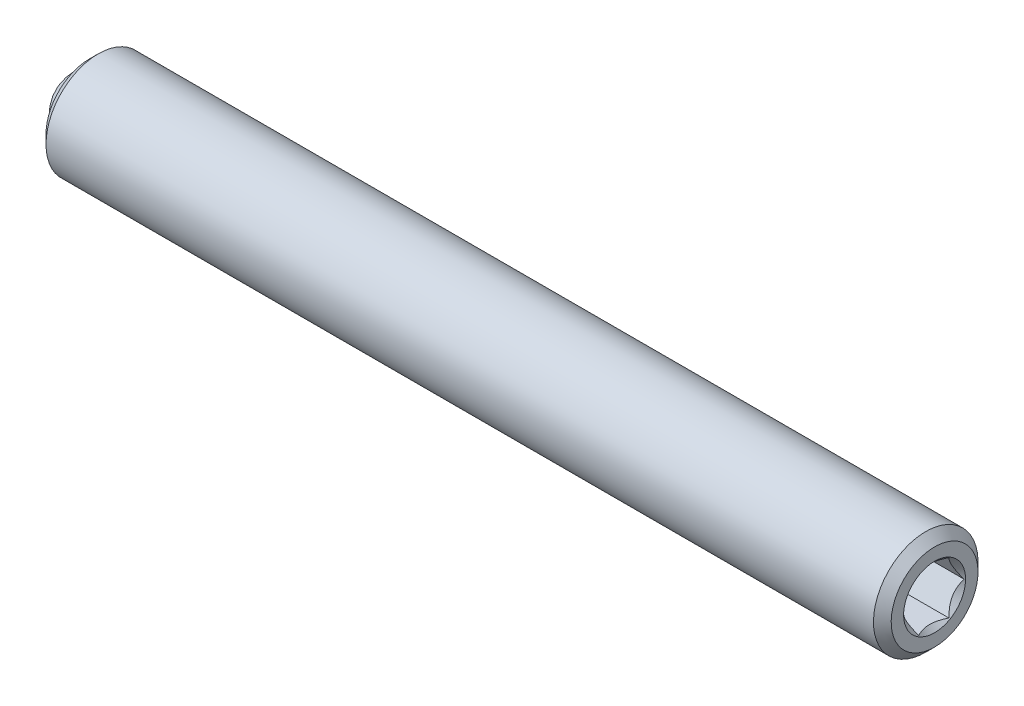
ISO-10303-21;
HEADER;
FILE_DESCRIPTION(('STEP AP214'),'2;1');
FILE_NAME('part.step','',(''),(''),'','','');
FILE_SCHEMA(('AUTOMOTIVE_DESIGN { 1 0 10303 214 1 1 1 1 }'));
ENDSEC;
DATA;
#1=APPLICATION_CONTEXT('core data for automotive mechanical design processes');
#2=APPLICATION_PROTOCOL_DEFINITION('international standard','automotive_design',2000,#1);
#3=PRODUCT_CONTEXT('',#1,'mechanical');
#4=PRODUCT('Part','Part','',(#3));
#5=PRODUCT_RELATED_PRODUCT_CATEGORY('part','',(#4));
#6=PRODUCT_DEFINITION_FORMATION('','',#4);
#7=PRODUCT_DEFINITION_CONTEXT('part definition',#1,'design');
#8=PRODUCT_DEFINITION('design','',#6,#7);
#9=PRODUCT_DEFINITION_SHAPE('','',#8);
#10=(LENGTH_UNIT() NAMED_UNIT(*) SI_UNIT(.MILLI.,.METRE.));
#11=(NAMED_UNIT(*) PLANE_ANGLE_UNIT() SI_UNIT($,.RADIAN.));
#12=(NAMED_UNIT(*) SI_UNIT($,.STERADIAN.) SOLID_ANGLE_UNIT());
#13=UNCERTAINTY_MEASURE_WITH_UNIT(LENGTH_MEASURE(1.E-05),#10,'distance_accuracy_value','');
#14=(GEOMETRIC_REPRESENTATION_CONTEXT(3) GLOBAL_UNCERTAINTY_ASSIGNED_CONTEXT((#13)) GLOBAL_UNIT_ASSIGNED_CONTEXT((#10,
#11,#12)) REPRESENTATION_CONTEXT('',''));
#15=CARTESIAN_POINT('',(0.,0.,0.));
#16=DIRECTION('',(0.,0.,1.));
#17=DIRECTION('',(1.,0.,0.));
#18=AXIS2_PLACEMENT_3D('',#15,#16,#17);
#19=CARTESIAN_POINT('',(-12.0876766483273,0.140112200938351,-0.203857779682182));
#20=DIRECTION('',(-1.,0.,0.));
#21=DIRECTION('',(0.,-1.,0.));
#22=AXIS2_PLACEMENT_3D('',#19,#20,#21);
#23=CONICAL_SURFACE('',#22,1.0033,0.785398163397449);
#24=CARTESIAN_POINT('',(-11.0843766483273,0.140112200938349,-0.203857779682182));
#25=VERTEX_POINT('',#24);
#26=VERTEX_LOOP('',#25);
#27=FACE_BOUND('',#26,.T.);
#28=CARTESIAN_POINT('',(-12.0876766483273,0.140112200938351,-0.203857779682182));
#29=DIRECTION('',(-1.,0.,0.));
#30=DIRECTION('',(0.,-1.,0.));
#31=AXIS2_PLACEMENT_3D('',#28,#29,#30);
#32=CIRCLE('',#31,1.0033);
#33=CARTESIAN_POINT('',(-12.0876766483273,-0.863187799061644,-0.203857779682182));
#34=VERTEX_POINT('',#33);
#35=EDGE_CURVE('P0_E102',#34,#34,#32,.T.);
#36=ORIENTED_EDGE('',*,*,#35,.T.);
#37=EDGE_LOOP('',(#36));
#38=FACE_BOUND('',#37,.T.);
#39=ADVANCED_FACE('P0_F17',(#27,#38),#23,.F.);
#40=CARTESIAN_POINT('',(11.4962410382164,0.140112200938291,-0.203857779682182));
#41=DIRECTION('',(-1.,0.,0.));
#42=DIRECTION('',(0.,-1.,0.));
#43=AXIS2_PLACEMENT_3D('',#40,#41,#42);
#44=PLANE('',#43);
#45=CARTESIAN_POINT('',(11.4962410382164,0.140112200938306,-0.203857779682182));
#46=DIRECTION('',(1.,0.,0.));
#47=DIRECTION('',(0.,1.,0.));
#48=AXIS2_PLACEMENT_3D('',#45,#46,#47);
#49=CIRCLE('',#48,0.889);
#50=CARTESIAN_POINT('',(11.4962410382164,1.02911220093831,-0.203857779682182));
#51=VERTEX_POINT('',#50);
#52=EDGE_CURVE('P0_E233',#51,#51,#49,.T.);
#53=ORIENTED_EDGE('',*,*,#52,.F.);
#54=EDGE_LOOP('',(#53));
#55=FACE_BOUND('',#54,.T.);
#56=CARTESIAN_POINT('',(11.4962410382164,0.140112200938291,-0.203857779682182));
#57=DIRECTION('',(-1.,0.,0.));
#58=DIRECTION('',(0.,-1.,0.));
#59=AXIS2_PLACEMENT_3D('',#56,#57,#58);
#60=CIRCLE('',#59,1.24599999999999);
#61=CARTESIAN_POINT('',(11.4962410382164,-1.1058877990617,-0.203857779682182));
#62=VERTEX_POINT('',#61);
#63=EDGE_CURVE('P0_E114',#62,#62,#60,.F.);
#64=ORIENTED_EDGE('',*,*,#63,.T.);
#65=EDGE_LOOP('',(#64));
#66=FACE_BOUND('',#65,.T.);
#67=ADVANCED_FACE('P0_F136',(#55,#66),#44,.F.);
#68=CARTESIAN_POINT('',(-11.0843766483273,0.140112200938349,-0.203857779682182));
#69=DIRECTION('',(-1.,0.,0.));
#70=DIRECTION('',(0.,-1.,0.));
#71=AXIS2_PLACEMENT_3D('',#68,#69,#70);
#72=CYLINDRICAL_SURFACE('',#71,1.49999999999999);
#73=CARTESIAN_POINT('',(11.2422410382164,0.140112200938292,-0.203857779682182));
#74=DIRECTION('',(-1.,0.,0.));
#75=DIRECTION('',(0.,-1.,0.));
#76=AXIS2_PLACEMENT_3D('',#73,#74,#75);
#77=CIRCLE('',#76,1.49999999999999);
#78=CARTESIAN_POINT('',(11.2422410382164,-1.3598877990617,-0.203857779682182));
#79=VERTEX_POINT('',#78);
#80=EDGE_CURVE('P0_E111',#79,#79,#77,.T.);
#81=ORIENTED_EDGE('',*,*,#80,.T.);
#82=EDGE_LOOP('',(#81));
#83=FACE_BOUND('',#82,.T.);
#84=CARTESIAN_POINT('',(-12.5067589617836,0.140112200938352,-0.203857779682182));
#85=DIRECTION('',(1.,0.,0.));
#86=DIRECTION('',(0.,1.,0.));
#87=AXIS2_PLACEMENT_3D('',#84,#85,#86);
#88=CIRCLE('',#87,1.49999999999999);
#89=CARTESIAN_POINT('',(-12.5067589617836,1.64011220093835,-0.203857779682182));
#90=VERTEX_POINT('',#89);
#91=EDGE_CURVE('P0_E108',#90,#90,#88,.T.);
#92=ORIENTED_EDGE('',*,*,#91,.T.);
#93=EDGE_LOOP('',(#92));
#94=FACE_BOUND('',#93,.T.);
#95=ADVANCED_FACE('P0_F141',(#83,#94),#72,.T.);
#96=CARTESIAN_POINT('',(-12.7607589617836,1.64011220093834,-0.203857779682182));
#97=DIRECTION('',(1.,0.,0.));
#98=DIRECTION('',(0.,1.,0.));
#99=AXIS2_PLACEMENT_3D('',#96,#97,#98);
#100=PLANE('',#99);
#101=CARTESIAN_POINT('',(-12.7607589617836,0.140112200938353,-0.203857779682182));
#102=DIRECTION('',(1.,0.,0.));
#103=DIRECTION('',(0.,1.,0.));
#104=AXIS2_PLACEMENT_3D('',#101,#102,#103);
#105=CIRCLE('',#104,1.24599999999998);
#106=CARTESIAN_POINT('',(-12.7607589617836,1.38611220093834,-0.203857779682182));
#107=VERTEX_POINT('',#106);
#108=EDGE_CURVE('P0_E30',#107,#107,#105,.F.);
#109=ORIENTED_EDGE('',*,*,#108,.T.);
#110=EDGE_LOOP('',(#109));
#111=FACE_BOUND('',#110,.T.);
#112=CARTESIAN_POINT('',(-12.7607589617836,0.140112200938353,-0.203857779682182));
#113=DIRECTION('',(-1.,0.,0.));
#114=DIRECTION('',(0.,-1.,0.));
#115=AXIS2_PLACEMENT_3D('',#112,#113,#114);
#116=CIRCLE('',#115,1.00329999999999);
#117=CARTESIAN_POINT('',(-12.7607589617836,-0.863187799061641,-0.203857779682182));
#118=VERTEX_POINT('',#117);
#119=EDGE_CURVE('P0_E105',#118,#118,#116,.T.);
#120=ORIENTED_EDGE('',*,*,#119,.F.);
#121=EDGE_LOOP('',(#120));
#122=FACE_BOUND('',#121,.T.);
#123=ADVANCED_FACE('P0_F119',(#111,#122),#100,.F.);
#124=CARTESIAN_POINT('',(-11.0843766483273,0.140112200938349,-0.203857779682182));
#125=DIRECTION('',(-1.,0.,0.));
#126=DIRECTION('',(0.,-1.,0.));
#127=AXIS2_PLACEMENT_3D('',#124,#125,#126);
#128=CYLINDRICAL_SURFACE('',#127,1.00329999999999);
#129=ORIENTED_EDGE('',*,*,#35,.F.);
#130=EDGE_LOOP('',(#129));
#131=FACE_BOUND('',#130,.T.);
#132=ORIENTED_EDGE('',*,*,#119,.T.);
#133=EDGE_LOOP('',(#132));
#134=FACE_BOUND('',#133,.T.);
#135=ADVANCED_FACE('P0_F132',(#131,#134),#128,.F.);
#136=CARTESIAN_POINT('',(11.2422410382164,0.140112200938292,-0.203857779682182));
#137=DIRECTION('',(-1.,0.,0.));
#138=DIRECTION('',(0.,-1.,0.));
#139=AXIS2_PLACEMENT_3D('',#136,#137,#138);
#140=CONICAL_SURFACE('',#139,1.49999999999999,0.785398163397448);
#141=ORIENTED_EDGE('',*,*,#63,.F.);
#142=EDGE_LOOP('',(#141));
#143=FACE_BOUND('',#142,.T.);
#144=ORIENTED_EDGE('',*,*,#80,.F.);
#145=EDGE_LOOP('',(#144));
#146=FACE_BOUND('',#145,.T.);
#147=ADVANCED_FACE('P0_F123',(#143,#146),#140,.T.);
#148=CARTESIAN_POINT('',(-12.7607589617836,0.140112200938353,-0.203857779682182));
#149=DIRECTION('',(1.,0.,0.));
#150=DIRECTION('',(0.,1.,0.));
#151=AXIS2_PLACEMENT_3D('',#148,#149,#150);
#152=CONICAL_SURFACE('',#151,1.24599999999998,0.785398163397449);
#153=ORIENTED_EDGE('',*,*,#91,.F.);
#154=EDGE_LOOP('',(#153));
#155=FACE_BOUND('',#154,.T.);
#156=ORIENTED_EDGE('',*,*,#108,.F.);
#157=EDGE_LOOP('',(#156));
#158=FACE_BOUND('',#157,.T.);
#159=ADVANCED_FACE('P0_F19',(#155,#158),#152,.T.);
#160=CARTESIAN_POINT('',(11.4962410382164,0.140112200938306,-0.203857779682182));
#161=DIRECTION('',(1.,0.,0.));
#162=DIRECTION('',(0.,1.,0.));
#163=AXIS2_PLACEMENT_3D('',#160,#161,#162);
#164=CONICAL_SURFACE('',#163,0.889,0.78539816339745);
#165=ORIENTED_EDGE('',*,*,#52,.T.);
#166=EDGE_LOOP('',(#165));
#167=FACE_BOUND('',#166,.T.);
#168=CARTESIAN_POINT('',(11.7631140734213,0.890112200938306,-1.08337041376642));
#169=CARTESIAN_POINT('',(11.7468746832341,0.890112200938306,-1.06202509160145));
#170=CARTESIAN_POINT('',(11.7307897915934,0.890112200938306,-1.04056255210855));
#171=CARTESIAN_POINT('',(11.6989932711544,0.890112200938306,-0.997354976592305));
#172=CARTESIAN_POINT('',(11.6832817341236,0.890112200938306,-0.975609873107703));
#173=CARTESIAN_POINT('',(11.6365791702213,0.890112200938306,-0.909560196047776));
#174=CARTESIAN_POINT('',(11.606270028075,0.890112200938306,-0.864765498854596));
#175=CARTESIAN_POINT('',(11.5466220454934,0.890112200938306,-0.770727906275515));
#176=CARTESIAN_POINT('',(11.517448477595,0.890112200938306,-0.721378973441892));
#177=CARTESIAN_POINT('',(11.4639800306987,0.890112200938306,-0.620199376934197));
#178=CARTESIAN_POINT('',(11.4396686869311,0.890112200938306,-0.568377850861366));
#179=CARTESIAN_POINT('',(11.4099242718952,0.890112200938306,-0.490735867719132));
#180=CARTESIAN_POINT('',(11.4014151500841,0.890112200938306,-0.466103184649245));
#181=CARTESIAN_POINT('',(11.3863673119566,0.890112200938306,-0.416242867271859));
#182=CARTESIAN_POINT('',(11.3798287270591,0.890112200938306,-0.391015193404166));
#183=CARTESIAN_POINT('',(11.3639482636582,0.890112200938306,-0.315512298631348));
#184=CARTESIAN_POINT('',(11.3579465651935,0.890112200938306,-0.26445416986013));
#185=CARTESIAN_POINT('',(11.3566802825571,0.890112200938306,-0.164196712147121));
#186=CARTESIAN_POINT('',(11.3610054562512,0.890112200938306,-0.115002678515326));
#187=CARTESIAN_POINT('',(11.3741037634369,0.890112200938306,-0.0420620616490276));
#188=CARTESIAN_POINT('',(11.3796543317098,0.890112200938306,-0.0176697554062034));
#189=CARTESIAN_POINT('',(11.39269014752,0.890112200938306,0.0305909359781868));
#190=CARTESIAN_POINT('',(11.400175253486,0.890112200938306,0.0544593593194069));
#191=CARTESIAN_POINT('',(11.4263552832294,0.890112200938306,0.128893354137778));
#192=CARTESIAN_POINT('',(11.4480038967103,0.890112200938306,0.178414114438126));
#193=CARTESIAN_POINT('',(11.4961548764514,0.890112200938306,0.275137718963044));
#194=CARTESIAN_POINT('',(11.5226745388191,0.890112200938306,0.322331518140768));
#195=CARTESIAN_POINT('',(11.577408028815,0.890112200938306,0.412534674027944));
#196=CARTESIAN_POINT('',(11.605472996119,0.890112200938306,0.45563552184839));
#197=CARTESIAN_POINT('',(11.6488674205197,0.890112200938306,0.519135833486404));
#198=CARTESIAN_POINT('',(11.6634869667997,0.890112200938306,0.540028947034259));
#199=CARTESIAN_POINT('',(11.6931150856451,0.890112200938306,0.581529174968723));
#200=CARTESIAN_POINT('',(11.7081235505922,0.890112200938306,0.602136366100392));
#201=CARTESIAN_POINT('',(11.723293357204,0.890112200938306,0.622624391158504));
#202=B_SPLINE_CURVE_WITH_KNOTS('',3,(#168,#169,#170,#171,#172,#173,#174,#175,#176,#177,#178,
#179,#180,#181,#182,#183,#184,#185,#186,#187,#188,#189,#190,#191,#192,#193,#194,#195,#196,#197,
#198,#199,#200,#201),.UNSPECIFIED.,.F.,.F.,(4,2,2,2,2,2,2,2,2,2,2,2,2,2,2,2,4),(0.,
0.0804596117713125,0.160938799458304,0.323124453207642,0.494968571211659,0.666220542256047,
0.744331171691054,0.822447009327482,0.975597152071552,1.12276514370424,1.19774306448793,
1.27271549986629,1.43438364653569,1.59663734905404,1.75085876682928,1.82735598886285,
1.90383226462699),.UNSPECIFIED.);
#203=CARTESIAN_POINT('',(11.4732664420009,0.890112200938306,-0.636870481574401));
#204=VERTEX_POINT('',#203);
#205=CARTESIAN_POINT('',(11.4732664420009,0.890112200938306,0.229154922210038));
#206=VERTEX_POINT('',#205);
#207=EDGE_CURVE('P0_E86',#204,#206,#202,.T.);
#208=ORIENTED_EDGE('',*,*,#207,.F.);
#209=CARTESIAN_POINT('',(11.4733819351456,0.139912200938306,-1.06999865352046));
#210=CARTESIAN_POINT('',(11.4585005524648,0.165702163495988,-1.05510881169539));
#211=CARTESIAN_POINT('',(11.4444927076078,0.191923403066966,-1.0399699719706));
#212=CARTESIAN_POINT('',(11.4188439666831,0.245391909174013,-1.00909991557653));
#213=CARTESIAN_POINT('',(11.4072173537065,0.272644268398879,-0.993365758642));
#214=CARTESIAN_POINT('',(11.3873004877731,0.32759755131966,-0.961638465954834));
#215=CARTESIAN_POINT('',(11.3789601360822,0.355284457633816,-0.945653423141328));
#216=CARTESIAN_POINT('',(11.3661091839623,0.41126779606916,-0.913331427625548));
#217=CARTESIAN_POINT('',(11.3615889825897,0.439562515781952,-0.896995463582723));
#218=CARTESIAN_POINT('',(11.3575122750983,0.48832249020715,-0.868843879222655));
#219=CARTESIAN_POINT('',(11.356909238615,0.508724266593879,-0.857064908133831));
#220=CARTESIAN_POINT('',(11.3579209480164,0.549488335634667,-0.833529761899868));
#221=CARTESIAN_POINT('',(11.3595361829909,0.569850618589762,-0.821773592354428));
#222=CARTESIAN_POINT('',(11.3676025889739,0.630646744025131,-0.786672932968632));
#223=CARTESIAN_POINT('',(11.3772753778286,0.670778055934406,-0.763503109234879));
#224=CARTESIAN_POINT('',(11.4006227599732,0.741222601292333,-0.722831932009539));
#225=CARTESIAN_POINT('',(11.4130750000731,0.771865772947395,-0.705140088605665));
#226=CARTESIAN_POINT('',(11.4411260522317,0.831951546743099,-0.670449550930248));
#227=CARTESIAN_POINT('',(11.4567146279046,0.8613976893199,-0.653448812586936));
#228=CARTESIAN_POINT('',(11.4733819351456,0.89031220093831,-0.63675501152056));
#229=B_SPLINE_CURVE_WITH_KNOTS('',3,(#209,#210,#211,#212,#213,#214,#215,#216,#217,#218,#219,
#220,#221,#222,#223,#224,#225,#226,#227,#228),.UNSPECIFIED.,.F.,.F.,(4,2,2,2,2,2,2,2,2,4),(0.,
0.0999419466095608,0.200466857654448,0.299393763705719,0.398071297300232,0.468665775681749,
0.539275821398841,0.680536257244568,0.792918418368078,0.904939568716038),.UNSPECIFIED.);
#230=CARTESIAN_POINT('',(11.4732664420009,0.140112200938306,-1.06988318346662));
#231=VERTEX_POINT('',#230);
#232=EDGE_CURVE('P0_E188',#231,#204,#229,.T.);
#233=ORIENTED_EDGE('',*,*,#232,.F.);
#234=CARTESIAN_POINT('',(11.4733819351456,-0.610087799061694,-0.636755011520563));
#235=CARTESIAN_POINT('',(11.4585005524648,-0.584297836504012,-0.651644853345631));
#236=CARTESIAN_POINT('',(11.4444927076078,-0.558076596933035,-0.66678369307042));
#237=CARTESIAN_POINT('',(11.4188439666831,-0.504608090825988,-0.697653749464491));
#238=CARTESIAN_POINT('',(11.4072173537065,-0.477355731601121,-0.71338790639902));
#239=CARTESIAN_POINT('',(11.3873004877731,-0.422402448680341,-0.745115199086186));
#240=CARTESIAN_POINT('',(11.3789601360822,-0.394715542366185,-0.761100241899692));
#241=CARTESIAN_POINT('',(11.3661091839623,-0.338732203930841,-0.793422237415472));
#242=CARTESIAN_POINT('',(11.3615889825897,-0.310437484218049,-0.809758201458298));
#243=CARTESIAN_POINT('',(11.3575122750983,-0.26167750979285,-0.837909785818365));
#244=CARTESIAN_POINT('',(11.356909238615,-0.241275733406121,-0.84968875690719));
#245=CARTESIAN_POINT('',(11.3579209480164,-0.200511664365333,-0.873223903141153));
#246=CARTESIAN_POINT('',(11.3595361829909,-0.180149381410238,-0.884980072686593));
#247=CARTESIAN_POINT('',(11.3676025889739,-0.11935325597487,-0.920080732072389));
#248=CARTESIAN_POINT('',(11.3772753778286,-0.0792219440655944,-0.943250555806142));
#249=CARTESIAN_POINT('',(11.4006227599732,-0.00877739870766725,-0.983921733031482));
#250=CARTESIAN_POINT('',(11.4130750000731,0.021865772947394,-1.00161357643536));
#251=CARTESIAN_POINT('',(11.4411260522317,0.0819515467430983,-1.03630411411077));
#252=CARTESIAN_POINT('',(11.4567146279046,0.1113976893199,-1.05330485245408));
#253=CARTESIAN_POINT('',(11.4733819351456,0.140312200938309,-1.06999865352046));
#254=B_SPLINE_CURVE_WITH_KNOTS('',3,(#234,#235,#236,#237,#238,#239,#240,#241,#242,#243,#244,
#245,#246,#247,#248,#249,#250,#251,#252,#253),.UNSPECIFIED.,.F.,.F.,(4,2,2,2,2,2,2,2,2,4),(0.,
0.0999419466095591,0.200466857654446,0.299393763705717,0.39807129730023,0.468665775681748,
0.539275821398839,0.680536257244566,0.792918418368076,0.904939568716036),.UNSPECIFIED.);
#255=CARTESIAN_POINT('',(11.4732664420009,-0.609887799061694,-0.636870481574401));
#256=VERTEX_POINT('',#255);
#257=EDGE_CURVE('P0_E183',#256,#231,#254,.T.);
#258=ORIENTED_EDGE('',*,*,#257,.F.);
#259=CARTESIAN_POINT('',(11.7631140734213,-0.609887799061694,-1.08337041376642));
#260=CARTESIAN_POINT('',(11.7468746832341,-0.609887799061694,-1.06202509160144));
#261=CARTESIAN_POINT('',(11.7307897915934,-0.609887799061694,-1.04056255210855));
#262=CARTESIAN_POINT('',(11.6989932711544,-0.609887799061694,-0.997354976592302));
#263=CARTESIAN_POINT('',(11.6832817341236,-0.609887799061694,-0.975609873107701));
#264=CARTESIAN_POINT('',(11.6365791702213,-0.609887799061694,-0.909560196047773));
#265=CARTESIAN_POINT('',(11.606270028075,-0.609887799061694,-0.864765498854593));
#266=CARTESIAN_POINT('',(11.5466220454934,-0.609887799061694,-0.770727906275512));
#267=CARTESIAN_POINT('',(11.517448477595,-0.609887799061694,-0.721378973441888));
#268=CARTESIAN_POINT('',(11.4639800306987,-0.609887799061694,-0.620199376934192));
#269=CARTESIAN_POINT('',(11.4396686869311,-0.609887799061694,-0.568377850861363));
#270=CARTESIAN_POINT('',(11.4099242718952,-0.609887799061694,-0.49073586771913));
#271=CARTESIAN_POINT('',(11.4014151500841,-0.609887799061694,-0.466103184649243));
#272=CARTESIAN_POINT('',(11.3863673119566,-0.609887799061694,-0.416242867271857));
#273=CARTESIAN_POINT('',(11.3798287270591,-0.609887799061694,-0.391015193404164));
#274=CARTESIAN_POINT('',(11.3639482636582,-0.609887799061694,-0.315512298631347));
#275=CARTESIAN_POINT('',(11.3579465651935,-0.609887799061694,-0.264454169860129));
#276=CARTESIAN_POINT('',(11.3566802825571,-0.609887799061694,-0.16419671214712));
#277=CARTESIAN_POINT('',(11.3610054562512,-0.609887799061694,-0.115002678515325));
#278=CARTESIAN_POINT('',(11.3741037634369,-0.609887799061694,-0.0420620616490272));
#279=CARTESIAN_POINT('',(11.3796543317098,-0.609887799061694,-0.0176697554062032));
#280=CARTESIAN_POINT('',(11.39269014752,-0.609887799061694,0.0305909359781866));
#281=CARTESIAN_POINT('',(11.400175253486,-0.609887799061694,0.0544593593194065));
#282=CARTESIAN_POINT('',(11.4263552832294,-0.609887799061694,0.128893354137778));
#283=CARTESIAN_POINT('',(11.4480038967103,-0.609887799061694,0.178414114438125));
#284=CARTESIAN_POINT('',(11.4961548764514,-0.609887799061694,0.275137718963044));
#285=CARTESIAN_POINT('',(11.5226745388191,-0.609887799061694,0.322331518140768));
#286=CARTESIAN_POINT('',(11.577408028815,-0.609887799061694,0.412534674027944));
#287=CARTESIAN_POINT('',(11.605472996119,-0.609887799061694,0.455635521848389));
#288=CARTESIAN_POINT('',(11.6488674205197,-0.609887799061694,0.519135833486403));
#289=CARTESIAN_POINT('',(11.6634869667997,-0.609887799061694,0.540028947034258));
#290=CARTESIAN_POINT('',(11.6931150856451,-0.609887799061694,0.581529174968721));
#291=CARTESIAN_POINT('',(11.7081235505922,-0.609887799061694,0.602136366100391));
#292=CARTESIAN_POINT('',(11.723293357204,-0.609887799061694,0.622624391158503));
#293=B_SPLINE_CURVE_WITH_KNOTS('',3,(#259,#260,#261,#262,#263,#264,#265,#266,#267,#268,#269,
#270,#271,#272,#273,#274,#275,#276,#277,#278,#279,#280,#281,#282,#283,#284,#285,#286,#287,#288,
#289,#290,#291,#292),.UNSPECIFIED.,.F.,.F.,(4,2,2,2,2,2,2,2,2,2,2,2,2,2,2,2,4),(0.,
0.0804596117713116,0.160938799458304,0.323124453207643,0.494968571211661,0.666220542256047,
0.744331171691053,0.82244700932748,0.97559715207155,1.12276514370423,1.19774306448793,
1.27271549986629,1.43438364653569,1.59663734905404,1.75085876682927,1.82735598886284,
1.90383226462699),.UNSPECIFIED.);
#294=CARTESIAN_POINT('',(11.4732664420009,-0.609887799061694,0.229154922210038));
#295=VERTEX_POINT('',#294);
#296=EDGE_CURVE('P0_E37',#295,#256,#293,.F.);
#297=ORIENTED_EDGE('',*,*,#296,.F.);
#298=CARTESIAN_POINT('',(11.4733819351456,0.140312200938309,0.662283094156097));
#299=CARTESIAN_POINT('',(11.4585005524648,0.114522238380628,0.647393252331029));
#300=CARTESIAN_POINT('',(11.4444927076078,0.0883009988096501,0.632254412606239));
#301=CARTESIAN_POINT('',(11.4188439666831,0.0348324927026026,0.601384356212168));
#302=CARTESIAN_POINT('',(11.4072173537065,0.00758013347773599,0.585650199277639));
#303=CARTESIAN_POINT('',(11.3873004877731,-0.0473731494430449,0.553922906590473));
#304=CARTESIAN_POINT('',(11.3789601360822,-0.0750600557572016,0.537937863776966));
#305=CARTESIAN_POINT('',(11.3661091839623,-0.131043394192546,0.505615868261187));
#306=CARTESIAN_POINT('',(11.3615889825897,-0.159338113905338,0.489279904218361));
#307=CARTESIAN_POINT('',(11.3575122750983,-0.208098088330536,0.461128319858293));
#308=CARTESIAN_POINT('',(11.356909238615,-0.228499864717265,0.449349348769469));
#309=CARTESIAN_POINT('',(11.3579209480164,-0.269263933758053,0.425814202535506));
#310=CARTESIAN_POINT('',(11.3595361829909,-0.289626216713148,0.414058032990066));
#311=CARTESIAN_POINT('',(11.3676025889739,-0.350422342148516,0.37895737360427));
#312=CARTESIAN_POINT('',(11.3772753778286,-0.390553654057792,0.355787549870517));
#313=CARTESIAN_POINT('',(11.4006227599732,-0.460998199415719,0.315116372645177));
#314=CARTESIAN_POINT('',(11.4130750000731,-0.49164137107078,0.297424529241304));
#315=CARTESIAN_POINT('',(11.4411260522317,-0.551727144866483,0.262733991565887));
#316=CARTESIAN_POINT('',(11.4567146279046,-0.581173287443284,0.245733253222575));
#317=CARTESIAN_POINT('',(11.4733819351456,-0.610087799061694,0.2290394521562));
#318=B_SPLINE_CURVE_WITH_KNOTS('',3,(#298,#299,#300,#301,#302,#303,#304,#305,#306,#307,#308,
#309,#310,#311,#312,#313,#314,#315,#316,#317),.UNSPECIFIED.,.F.,.F.,(4,2,2,2,2,2,2,2,2,4),(0.,
0.0999419466095603,0.200466857654447,0.29939376370572,0.398071297300234,0.468665775681751,
0.539275821398842,0.680536257244569,0.792918418368077,0.904939568716035),.UNSPECIFIED.);
#319=CARTESIAN_POINT('',(11.4732664420009,0.140112200938306,0.662167624102257));
#320=VERTEX_POINT('',#319);
#321=EDGE_CURVE('P0_E11',#320,#295,#318,.T.);
#322=ORIENTED_EDGE('',*,*,#321,.F.);
#323=CARTESIAN_POINT('',(11.4733819351456,0.89031220093831,0.229039452156197));
#324=CARTESIAN_POINT('',(11.4585005524648,0.864522238380628,0.243929293981265));
#325=CARTESIAN_POINT('',(11.4444927076078,0.83830099880965,0.259068133706055));
#326=CARTESIAN_POINT('',(11.4188439666831,0.784832492702603,0.289938190100126));
#327=CARTESIAN_POINT('',(11.4072173537065,0.757580133477736,0.305672347034655));
#328=CARTESIAN_POINT('',(11.3873004877731,0.702626850556955,0.337399639721822));
#329=CARTESIAN_POINT('',(11.3789601360822,0.674939944242799,0.353384682535328));
#330=CARTESIAN_POINT('',(11.3661091839623,0.618956605807455,0.385706678051108));
#331=CARTESIAN_POINT('',(11.3615889825897,0.590661886094662,0.402042642093933));
#332=CARTESIAN_POINT('',(11.3575122750983,0.541901911669464,0.430194226454001));
#333=CARTESIAN_POINT('',(11.356909238615,0.521500135282735,0.441973197542826));
#334=CARTESIAN_POINT('',(11.3579209480164,0.480736066241947,0.465508343776789));
#335=CARTESIAN_POINT('',(11.3595361829909,0.460373783286852,0.477264513322228));
#336=CARTESIAN_POINT('',(11.3676025889739,0.399577657851483,0.512365172708025));
#337=CARTESIAN_POINT('',(11.3772753778286,0.359446345942208,0.535534996441778));
#338=CARTESIAN_POINT('',(11.4006227599732,0.289001800584281,0.576206173667117));
#339=CARTESIAN_POINT('',(11.4130750000731,0.25835862892922,0.593898017070991));
#340=CARTESIAN_POINT('',(11.4411260522317,0.198272855133516,0.628588554746408));
#341=CARTESIAN_POINT('',(11.4567146279046,0.168826712556715,0.64558929308972));
#342=CARTESIAN_POINT('',(11.4733819351456,0.139912200938306,0.662283094156095));
#343=B_SPLINE_CURVE_WITH_KNOTS('',3,(#323,#324,#325,#326,#327,#328,#329,#330,#331,#332,#333,
#334,#335,#336,#337,#338,#339,#340,#341,#342),.UNSPECIFIED.,.F.,.F.,(4,2,2,2,2,2,2,2,2,4),(0.,
0.0999419466095604,0.200466857654448,0.29939376370572,0.398071297300234,0.468665775681752,
0.539275821398843,0.68053625724457,0.792918418368079,0.904939568716037),.UNSPECIFIED.);
#344=EDGE_CURVE('P0_E73',#206,#320,#343,.T.);
#345=ORIENTED_EDGE('',*,*,#344,.F.);
#346=EDGE_LOOP('',(#208,#233,#258,#297,#322,#345));
#347=FACE_BOUND('',#346,.T.);
#348=ADVANCED_FACE('P0_F72',(#167,#347),#164,.F.);
#349=CARTESIAN_POINT('',(8.44824103821644,0.140112200938325,-0.203857779682182));
#350=DIRECTION('',(1.,0.,0.));
#351=DIRECTION('',(0.,1.,0.));
#352=AXIS2_PLACEMENT_3D('',#349,#350,#351);
#353=PLANE('',#352);
#354=DIRECTION('',(0.,-0.866025403784439,0.5));
#355=VECTOR('',#354,1.);
#356=CARTESIAN_POINT('',(8.44824103821644,0.89011220093831,0.229154922210038));
#357=LINE('',#356,#355);
#358=CARTESIAN_POINT('',(8.44824103821644,0.89011220093831,0.229154922210038));
#359=VERTEX_POINT('',#358);
#360=CARTESIAN_POINT('',(8.44824103821644,0.140112200938309,0.662167624102257));
#361=VERTEX_POINT('',#360);
#362=EDGE_CURVE('P0_E85',#359,#361,#357,.T.);
#363=ORIENTED_EDGE('',*,*,#362,.T.);
#364=DIRECTION('',(0.,-0.866025403784439,-0.5));
#365=VECTOR('',#364,1.);
#366=CARTESIAN_POINT('',(8.44824103821644,0.140112200938309,0.662167624102257));
#367=LINE('',#366,#365);
#368=CARTESIAN_POINT('',(8.44824103821643,-0.60988779906169,0.229154922210038));
#369=VERTEX_POINT('',#368);
#370=EDGE_CURVE('P0_E90',#361,#369,#367,.T.);
#371=ORIENTED_EDGE('',*,*,#370,.T.);
#372=DIRECTION('',(0.,0.,-1.));
#373=VECTOR('',#372,1.);
#374=CARTESIAN_POINT('',(8.44824103821643,-0.60988779906169,0.229154922210038));
#375=LINE('',#374,#373);
#376=CARTESIAN_POINT('',(8.44824103821643,-0.60988779906169,-0.636870481574401));
#377=VERTEX_POINT('',#376);
#378=EDGE_CURVE('P0_E213',#369,#377,#375,.T.);
#379=ORIENTED_EDGE('',*,*,#378,.T.);
#380=DIRECTION('',(0.,0.866025403784439,-0.5));
#381=VECTOR('',#380,1.);
#382=CARTESIAN_POINT('',(8.44824103821643,-0.60988779906169,-0.636870481574401));
#383=LINE('',#382,#381);
#384=CARTESIAN_POINT('',(8.44824103821644,0.14011220093831,-1.06988318346662));
#385=VERTEX_POINT('',#384);
#386=EDGE_CURVE('P0_E217',#377,#385,#383,.T.);
#387=ORIENTED_EDGE('',*,*,#386,.T.);
#388=DIRECTION('',(0.,0.866025403784439,0.5));
#389=VECTOR('',#388,1.);
#390=CARTESIAN_POINT('',(8.44824103821644,0.14011220093831,-1.06988318346662));
#391=LINE('',#390,#389);
#392=CARTESIAN_POINT('',(8.44824103821644,0.89011220093831,-0.636870481574401));
#393=VERTEX_POINT('',#392);
#394=EDGE_CURVE('P0_E98',#385,#393,#391,.T.);
#395=ORIENTED_EDGE('',*,*,#394,.T.);
#396=DIRECTION('',(0.,0.,1.));
#397=VECTOR('',#396,1.);
#398=CARTESIAN_POINT('',(8.44824103821644,0.89011220093831,-0.636870481574401));
#399=LINE('',#398,#397);
#400=EDGE_CURVE('P0_E93',#393,#359,#399,.T.);
#401=ORIENTED_EDGE('',*,*,#400,.T.);
#402=EDGE_LOOP('',(#363,#371,#379,#387,#395,#401));
#403=FACE_BOUND('',#402,.T.);
#404=ADVANCED_FACE('P0_F130',(#403),#353,.T.);
#405=CARTESIAN_POINT('',(8.44824103821644,0.140112200938309,0.662167624102257));
#406=DIRECTION('',(0.,-0.5,0.866025403784439));
#407=DIRECTION('',(0.,-0.866025403784439,-0.5));
#408=AXIS2_PLACEMENT_3D('',#405,#406,#407);
#409=PLANE('',#408);
#410=DIRECTION('',(1.,0.,0.));
#411=VECTOR('',#410,1.);
#412=CARTESIAN_POINT('',(8.44824103821644,0.140112200938309,0.662167624102257));
#413=LINE('',#412,#411);
#414=EDGE_CURVE('P0_E82',#361,#320,#413,.T.);
#415=ORIENTED_EDGE('',*,*,#414,.T.);
#416=ORIENTED_EDGE('',*,*,#321,.T.);
#417=DIRECTION('',(1.,0.,0.));
#418=VECTOR('',#417,1.);
#419=CARTESIAN_POINT('',(8.44824103821643,-0.60988779906169,0.229154922210038));
#420=LINE('',#419,#418);
#421=EDGE_CURVE('P0_E92',#369,#295,#420,.T.);
#422=ORIENTED_EDGE('',*,*,#421,.F.);
#423=ORIENTED_EDGE('',*,*,#370,.F.);
#424=EDGE_LOOP('',(#415,#416,#422,#423));
#425=FACE_BOUND('',#424,.T.);
#426=ADVANCED_FACE('P0_F88',(#425),#409,.F.);
#427=CARTESIAN_POINT('',(8.44824103821643,-0.60988779906169,0.229154922210038));
#428=DIRECTION('',(0.,-1.,0.));
#429=DIRECTION('',(1.,0.,0.));
#430=AXIS2_PLACEMENT_3D('',#427,#428,#429);
#431=PLANE('',#430);
#432=ORIENTED_EDGE('',*,*,#421,.T.);
#433=ORIENTED_EDGE('',*,*,#296,.T.);
#434=DIRECTION('',(1.,0.,0.));
#435=VECTOR('',#434,1.);
#436=CARTESIAN_POINT('',(8.44824103821643,-0.60988779906169,-0.636870481574401));
#437=LINE('',#436,#435);
#438=EDGE_CURVE('P0_E95',#377,#256,#437,.T.);
#439=ORIENTED_EDGE('',*,*,#438,.F.);
#440=ORIENTED_EDGE('',*,*,#378,.F.);
#441=EDGE_LOOP('',(#432,#433,#439,#440));
#442=FACE_BOUND('',#441,.T.);
#443=ADVANCED_FACE('P0_F202',(#442),#431,.F.);
#444=CARTESIAN_POINT('',(8.44824103821643,-0.60988779906169,-0.636870481574401));
#445=DIRECTION('',(0.,-0.5,-0.866025403784439));
#446=DIRECTION('',(0.,0.866025403784439,-0.5));
#447=AXIS2_PLACEMENT_3D('',#444,#445,#446);
#448=PLANE('',#447);
#449=ORIENTED_EDGE('',*,*,#438,.T.);
#450=ORIENTED_EDGE('',*,*,#257,.T.);
#451=DIRECTION('',(1.,0.,0.));
#452=VECTOR('',#451,1.);
#453=CARTESIAN_POINT('',(8.44824103821644,0.14011220093831,-1.06988318346662));
#454=LINE('',#453,#452);
#455=EDGE_CURVE('P0_E227',#385,#231,#454,.T.);
#456=ORIENTED_EDGE('',*,*,#455,.F.);
#457=ORIENTED_EDGE('',*,*,#386,.F.);
#458=EDGE_LOOP('',(#449,#450,#456,#457));
#459=FACE_BOUND('',#458,.T.);
#460=ADVANCED_FACE('P0_F197',(#459),#448,.F.);
#461=CARTESIAN_POINT('',(8.44824103821644,0.14011220093831,-1.06988318346662));
#462=DIRECTION('',(0.,0.5,-0.866025403784439));
#463=DIRECTION('',(0.,0.866025403784439,0.5));
#464=AXIS2_PLACEMENT_3D('',#461,#462,#463);
#465=PLANE('',#464);
#466=ORIENTED_EDGE('',*,*,#455,.T.);
#467=ORIENTED_EDGE('',*,*,#232,.T.);
#468=DIRECTION('',(1.,0.,0.));
#469=VECTOR('',#468,1.);
#470=CARTESIAN_POINT('',(8.44824103821644,0.89011220093831,-0.636870481574401));
#471=LINE('',#470,#469);
#472=EDGE_CURVE('P0_E224',#393,#204,#471,.T.);
#473=ORIENTED_EDGE('',*,*,#472,.F.);
#474=ORIENTED_EDGE('',*,*,#394,.F.);
#475=EDGE_LOOP('',(#466,#467,#473,#474));
#476=FACE_BOUND('',#475,.T.);
#477=ADVANCED_FACE('P0_F194',(#476),#465,.F.);
#478=CARTESIAN_POINT('',(8.44824103821644,0.89011220093831,-0.636870481574401));
#479=DIRECTION('',(0.,1.,0.));
#480=DIRECTION('',(-1.,0.,0.));
#481=AXIS2_PLACEMENT_3D('',#478,#479,#480);
#482=PLANE('',#481);
#483=ORIENTED_EDGE('',*,*,#472,.T.);
#484=ORIENTED_EDGE('',*,*,#207,.T.);
#485=DIRECTION('',(1.,0.,0.));
#486=VECTOR('',#485,1.);
#487=CARTESIAN_POINT('',(8.44824103821644,0.89011220093831,0.229154922210038));
#488=LINE('',#487,#486);
#489=EDGE_CURVE('P0_E84',#359,#206,#488,.T.);
#490=ORIENTED_EDGE('',*,*,#489,.F.);
#491=ORIENTED_EDGE('',*,*,#400,.F.);
#492=EDGE_LOOP('',(#483,#484,#490,#491));
#493=FACE_BOUND('',#492,.T.);
#494=ADVANCED_FACE('P0_F156',(#493),#482,.F.);
#495=CARTESIAN_POINT('',(8.44824103821644,0.89011220093831,0.229154922210038));
#496=DIRECTION('',(0.,0.5,0.866025403784439));
#497=DIRECTION('',(0.,-0.866025403784439,0.5));
#498=AXIS2_PLACEMENT_3D('',#495,#496,#497);
#499=PLANE('',#498);
#500=ORIENTED_EDGE('',*,*,#489,.T.);
#501=ORIENTED_EDGE('',*,*,#344,.T.);
#502=ORIENTED_EDGE('',*,*,#414,.F.);
#503=ORIENTED_EDGE('',*,*,#362,.F.);
#504=EDGE_LOOP('',(#500,#501,#502,#503));
#505=FACE_BOUND('',#504,.T.);
#506=ADVANCED_FACE('P0_F80',(#505),#499,.F.);
#507=CLOSED_SHELL('',(#39,#67,#95,#123,#135,#147,#159,#348,#404,#426,#443,#460,#477,#494,#506));
#508=MANIFOLD_SOLID_BREP('P0_B1',#507);
#509=CARTESIAN_POINT('',(-12.4985873822732,0.140112200938353,-0.203857779682182));
#510=DIRECTION('',(0.,0.,-1.));
#511=DIRECTION('',(0.,1.,0.));
#512=AXIS2_PLACEMENT_3D('',#509,#510,#511);
#513=SPHERICAL_SURFACE('',#512,0.999998);
#514=CARTESIAN_POINT('',(-12.4985873822732,0.140112200938353,-0.203857779682182));
#515=DIRECTION('',(-1.,0.,0.));
#516=DIRECTION('',(0.,1.,0.));
#517=AXIS2_PLACEMENT_3D('',#514,#515,#516);
#518=CIRCLE('',#517,0.999998);
#519=CARTESIAN_POINT('',(-12.4985873822732,1.14011020093835,-0.203857779682181));
#520=VERTEX_POINT('',#519);
#521=CARTESIAN_POINT('',(-12.4985873822733,-0.859885799061648,-0.203857779682182));
#522=VERTEX_POINT('',#521);
#523=EDGE_CURVE('P1_E33',#520,#522,#518,.T.);
#524=ORIENTED_EDGE('',*,*,#523,.T.);
#525=CARTESIAN_POINT('',(-12.4985873822732,0.140112200938353,-0.203857779682182));
#526=DIRECTION('',(0.,0.,-1.));
#527=DIRECTION('',(-1.,0.,0.));
#528=AXIS2_PLACEMENT_3D('',#525,#526,#527);
#529=CIRCLE('',#528,0.999998);
#530=EDGE_CURVE('P1_E10',#522,#520,#529,.T.);
#531=ORIENTED_EDGE('',*,*,#530,.T.);
#532=EDGE_LOOP('',(#524,#531));
#533=FACE_BOUND('',#532,.T.);
#534=ADVANCED_FACE('P1_F16',(#533),#513,.T.);
#535=ORIENTED_EDGE('',*,*,#523,.F.);
#536=CARTESIAN_POINT('',(-12.4985873822732,0.140112200938353,-0.203857779682182));
#537=DIRECTION('',(0.,0.,-1.));
#538=DIRECTION('',(-1.,0.,0.));
#539=AXIS2_PLACEMENT_3D('',#536,#537,#538);
#540=CIRCLE('',#539,0.999998);
#541=EDGE_CURVE('P1_E23',#520,#522,#540,.T.);
#542=ORIENTED_EDGE('',*,*,#541,.T.);
#543=EDGE_LOOP('',(#535,#542));
#544=FACE_BOUND('',#543,.T.);
#545=ADVANCED_FACE('P1_F40',(#544),#513,.T.);
#546=ORIENTED_EDGE('',*,*,#530,.F.);
#547=EDGE_CURVE('P1_E36',#522,#520,#518,.T.);
#548=ORIENTED_EDGE('',*,*,#547,.T.);
#549=EDGE_LOOP('',(#546,#548));
#550=FACE_BOUND('',#549,.T.);
#551=ADVANCED_FACE('P1_F38',(#550),#513,.T.);
#552=ORIENTED_EDGE('',*,*,#541,.F.);
#553=ORIENTED_EDGE('',*,*,#547,.F.);
#554=EDGE_LOOP('',(#552,#553));
#555=FACE_BOUND('',#554,.T.);
#556=ADVANCED_FACE('P1_F18',(#555),#513,.T.);
#557=CLOSED_SHELL('',(#534,#545,#551,#556));
#558=MANIFOLD_SOLID_BREP('P1_B1',#557);
#559=ADVANCED_BREP_SHAPE_REPRESENTATION('',(#18,#508,#558),#14);
#560=SHAPE_DEFINITION_REPRESENTATION(#9,#559);
ENDSEC;
END-ISO-10303-21;
